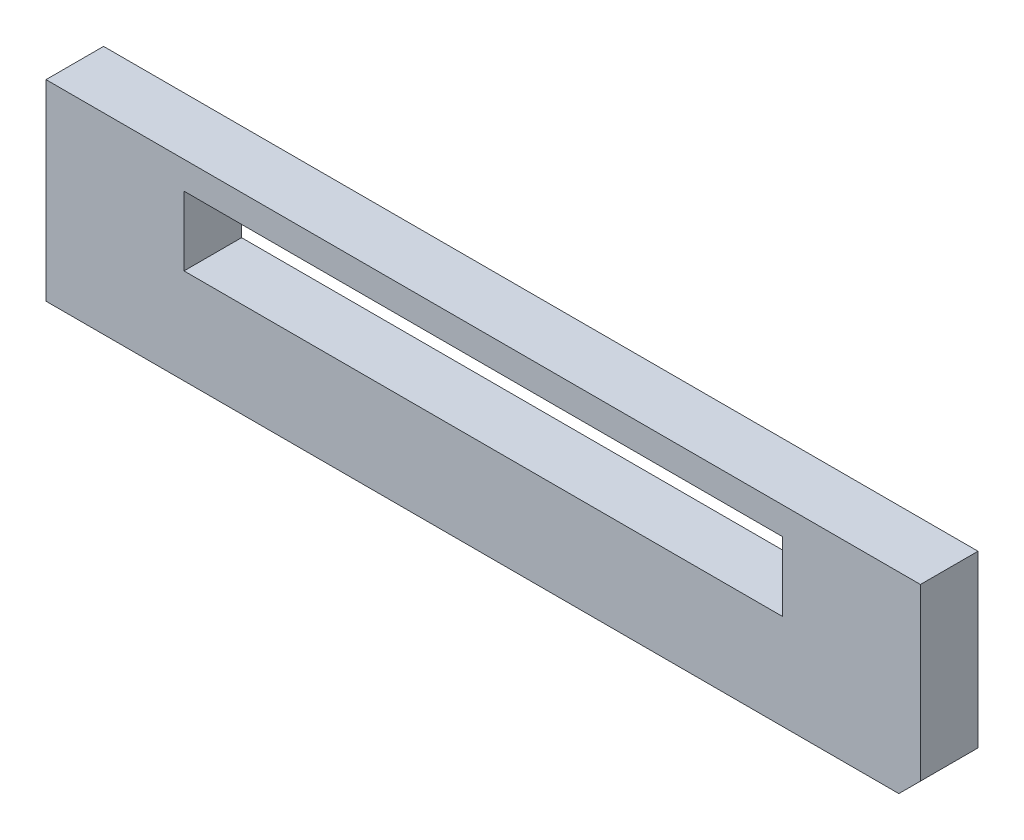
ISO-10303-21;
HEADER;
FILE_DESCRIPTION(('STEP AP214'),'2;1');
FILE_NAME('part.step','',(''),(''),'','','');
FILE_SCHEMA(('AUTOMOTIVE_DESIGN { 1 0 10303 214 1 1 1 1 }'));
ENDSEC;
DATA;
#1=APPLICATION_CONTEXT('core data for automotive mechanical design processes');
#2=APPLICATION_PROTOCOL_DEFINITION('international standard','automotive_design',2000,#1);
#3=PRODUCT_CONTEXT('',#1,'mechanical');
#4=PRODUCT('Part','Part','',(#3));
#5=PRODUCT_RELATED_PRODUCT_CATEGORY('part','',(#4));
#6=PRODUCT_DEFINITION_FORMATION('','',#4);
#7=PRODUCT_DEFINITION_CONTEXT('part definition',#1,'design');
#8=PRODUCT_DEFINITION('design','',#6,#7);
#9=PRODUCT_DEFINITION_SHAPE('','',#8);
#10=(LENGTH_UNIT() NAMED_UNIT(*) SI_UNIT(.MILLI.,.METRE.));
#11=(NAMED_UNIT(*) PLANE_ANGLE_UNIT() SI_UNIT($,.RADIAN.));
#12=(NAMED_UNIT(*) SI_UNIT($,.STERADIAN.) SOLID_ANGLE_UNIT());
#13=UNCERTAINTY_MEASURE_WITH_UNIT(LENGTH_MEASURE(1.E-05),#10,'distance_accuracy_value','');
#14=(GEOMETRIC_REPRESENTATION_CONTEXT(3) GLOBAL_UNCERTAINTY_ASSIGNED_CONTEXT((#13)) GLOBAL_UNIT_ASSIGNED_CONTEXT((#10,
#11,#12)) REPRESENTATION_CONTEXT('',''));
#15=CARTESIAN_POINT('',(0.,0.,0.));
#16=DIRECTION('',(0.,0.,1.));
#17=DIRECTION('',(1.,0.,0.));
#18=AXIS2_PLACEMENT_3D('',#15,#16,#17);
#19=CARTESIAN_POINT('',(0.,0.,5.34));
#20=DIRECTION('',(1.,0.,0.));
#21=DIRECTION('',(0.,0.,-1.));
#22=AXIS2_PLACEMENT_3D('',#19,#20,#21);
#23=PLANE('',#22);
#24=DIRECTION('',(0.,-1.,0.));
#25=VECTOR('',#24,1.);
#26=CARTESIAN_POINT('',(0.,0.,0.));
#27=LINE('',#26,#25);
#28=CARTESIAN_POINT('',(0.,17.8,0.));
#29=VERTEX_POINT('',#28);
#30=CARTESIAN_POINT('',(0.,0.,0.));
#31=VERTEX_POINT('',#30);
#32=EDGE_CURVE('E142',#29,#31,#27,.T.);
#33=ORIENTED_EDGE('',*,*,#32,.T.);
#34=DIRECTION('',(0.,0.,-1.));
#35=VECTOR('',#34,1.);
#36=CARTESIAN_POINT('',(0.,0.,5.34));
#37=LINE('',#36,#35);
#38=CARTESIAN_POINT('',(0.,0.,5.34));
#39=VERTEX_POINT('',#38);
#40=EDGE_CURVE('E171',#39,#31,#37,.T.);
#41=ORIENTED_EDGE('',*,*,#40,.F.);
#42=DIRECTION('',(0.,-1.,0.));
#43=VECTOR('',#42,1.);
#44=CARTESIAN_POINT('',(0.,0.,5.34));
#45=LINE('',#44,#43);
#46=CARTESIAN_POINT('',(0.,17.8,5.34));
#47=VERTEX_POINT('',#46);
#48=EDGE_CURVE('E146',#47,#39,#45,.T.);
#49=ORIENTED_EDGE('',*,*,#48,.F.);
#50=DIRECTION('',(0.,0.,-1.));
#51=VECTOR('',#50,1.);
#52=CARTESIAN_POINT('',(0.,17.8,5.34));
#53=LINE('',#52,#51);
#54=EDGE_CURVE('E157',#47,#29,#53,.T.);
#55=ORIENTED_EDGE('',*,*,#54,.T.);
#56=EDGE_LOOP('',(#33,#41,#49,#55));
#57=FACE_BOUND('',#56,.T.);
#58=ADVANCED_FACE('F38',(#57),#23,.F.);
#59=CARTESIAN_POINT('',(0.,0.,5.34));
#60=DIRECTION('',(0.,1.,0.));
#61=DIRECTION('',(0.,0.,1.));
#62=AXIS2_PLACEMENT_3D('',#59,#60,#61);
#63=PLANE('',#62);
#64=DIRECTION('',(1.,0.,0.));
#65=VECTOR('',#64,1.);
#66=CARTESIAN_POINT('',(0.,0.,0.));
#67=LINE('',#66,#65);
#68=CARTESIAN_POINT('',(79.1,0.,0.));
#69=VERTEX_POINT('',#68);
#70=EDGE_CURVE('E160',#31,#69,#67,.T.);
#71=ORIENTED_EDGE('',*,*,#70,.T.);
#72=DIRECTION('',(0.,0.,1.));
#73=VECTOR('',#72,1.);
#74=CARTESIAN_POINT('',(79.1,0.,5.34));
#75=LINE('',#74,#73);
#76=CARTESIAN_POINT('',(79.1,0.,5.34));
#77=VERTEX_POINT('',#76);
#78=EDGE_CURVE('E47',#69,#77,#75,.T.);
#79=ORIENTED_EDGE('',*,*,#78,.T.);
#80=DIRECTION('',(1.,0.,0.));
#81=VECTOR('',#80,1.);
#82=CARTESIAN_POINT('',(0.,0.,5.34));
#83=LINE('',#82,#81);
#84=EDGE_CURVE('E149',#39,#77,#83,.T.);
#85=ORIENTED_EDGE('',*,*,#84,.F.);
#86=ORIENTED_EDGE('',*,*,#40,.T.);
#87=EDGE_LOOP('',(#71,#79,#85,#86));
#88=FACE_BOUND('',#87,.T.);
#89=ADVANCED_FACE('F180',(#88),#63,.F.);
#90=CARTESIAN_POINT('',(81.1,0.,5.34));
#91=DIRECTION('',(-1.,0.,0.));
#92=DIRECTION('',(0.,0.,1.));
#93=AXIS2_PLACEMENT_3D('',#90,#91,#92);
#94=PLANE('',#93);
#95=DIRECTION('',(0.,1.,0.));
#96=VECTOR('',#95,1.);
#97=CARTESIAN_POINT('',(81.1,0.,5.34));
#98=LINE('',#97,#96);
#99=CARTESIAN_POINT('',(81.1,2.,5.34));
#100=VERTEX_POINT('',#99);
#101=CARTESIAN_POINT('',(81.1,17.8,5.34));
#102=VERTEX_POINT('',#101);
#103=EDGE_CURVE('E153',#100,#102,#98,.T.);
#104=ORIENTED_EDGE('',*,*,#103,.F.);
#105=DIRECTION('',(0.,0.,-1.));
#106=VECTOR('',#105,1.);
#107=CARTESIAN_POINT('',(81.1,2.,5.34));
#108=LINE('',#107,#106);
#109=CARTESIAN_POINT('',(81.1,2.,0.));
#110=VERTEX_POINT('',#109);
#111=EDGE_CURVE('E174',#100,#110,#108,.T.);
#112=ORIENTED_EDGE('',*,*,#111,.T.);
#113=DIRECTION('',(0.,1.,0.));
#114=VECTOR('',#113,1.);
#115=CARTESIAN_POINT('',(81.1,0.,0.));
#116=LINE('',#115,#114);
#117=CARTESIAN_POINT('',(81.1,17.8,0.));
#118=VERTEX_POINT('',#117);
#119=EDGE_CURVE('E163',#110,#118,#116,.T.);
#120=ORIENTED_EDGE('',*,*,#119,.T.);
#121=DIRECTION('',(0.,0.,-1.));
#122=VECTOR('',#121,1.);
#123=CARTESIAN_POINT('',(81.1,17.8,5.34));
#124=LINE('',#123,#122);
#125=EDGE_CURVE('E168',#102,#118,#124,.T.);
#126=ORIENTED_EDGE('',*,*,#125,.F.);
#127=EDGE_LOOP('',(#104,#112,#120,#126));
#128=FACE_BOUND('',#127,.T.);
#129=ADVANCED_FACE('F191',(#128),#94,.F.);
#130=CARTESIAN_POINT('',(0.,17.8,5.34));
#131=DIRECTION('',(0.,-1.,0.));
#132=DIRECTION('',(0.,0.,-1.));
#133=AXIS2_PLACEMENT_3D('',#130,#131,#132);
#134=PLANE('',#133);
#135=DIRECTION('',(-1.,0.,0.));
#136=VECTOR('',#135,1.);
#137=CARTESIAN_POINT('',(0.,17.8,0.));
#138=LINE('',#137,#136);
#139=EDGE_CURVE('E150',#118,#29,#138,.T.);
#140=ORIENTED_EDGE('',*,*,#139,.T.);
#141=ORIENTED_EDGE('',*,*,#54,.F.);
#142=DIRECTION('',(-1.,0.,0.));
#143=VECTOR('',#142,1.);
#144=CARTESIAN_POINT('',(0.,17.8,5.34));
#145=LINE('',#144,#143);
#146=EDGE_CURVE('E155',#102,#47,#145,.T.);
#147=ORIENTED_EDGE('',*,*,#146,.F.);
#148=ORIENTED_EDGE('',*,*,#125,.T.);
#149=EDGE_LOOP('',(#140,#141,#147,#148));
#150=FACE_BOUND('',#149,.T.);
#151=ADVANCED_FACE('F197',(#150),#134,.F.);
#152=CARTESIAN_POINT('',(0.,0.,5.34));
#153=DIRECTION('',(0.,0.,-1.));
#154=DIRECTION('',(-1.,0.,0.));
#155=AXIS2_PLACEMENT_3D('',#152,#153,#154);
#156=PLANE('',#155);
#157=DIRECTION('',(1.,0.,0.));
#158=VECTOR('',#157,1.);
#159=CARTESIAN_POINT('',(12.8,8.83392320543626,5.34));
#160=LINE('',#159,#158);
#161=CARTESIAN_POINT('',(12.8,8.83392320543626,5.34));
#162=VERTEX_POINT('',#161);
#163=CARTESIAN_POINT('',(68.3,8.83392320543626,5.34));
#164=VERTEX_POINT('',#163);
#165=EDGE_CURVE('E136',#162,#164,#160,.T.);
#166=ORIENTED_EDGE('',*,*,#165,.F.);
#167=DIRECTION('',(0.,-1.,0.));
#168=VECTOR('',#167,1.);
#169=CARTESIAN_POINT('',(12.8,8.83392320543626,5.34));
#170=LINE('',#169,#168);
#171=CARTESIAN_POINT('',(12.8,15.24337227812,5.34));
#172=VERTEX_POINT('',#171);
#173=EDGE_CURVE('E54',#172,#162,#170,.T.);
#174=ORIENTED_EDGE('',*,*,#173,.F.);
#175=DIRECTION('',(-1.,0.,0.));
#176=VECTOR('',#175,1.);
#177=CARTESIAN_POINT('',(12.8,15.24337227812,5.34));
#178=LINE('',#177,#176);
#179=CARTESIAN_POINT('',(68.3,15.24337227812,5.34));
#180=VERTEX_POINT('',#179);
#181=EDGE_CURVE('E127',#180,#172,#178,.T.);
#182=ORIENTED_EDGE('',*,*,#181,.F.);
#183=DIRECTION('',(0.,1.,0.));
#184=VECTOR('',#183,1.);
#185=CARTESIAN_POINT('',(68.3,8.83392320543626,5.34));
#186=LINE('',#185,#184);
#187=EDGE_CURVE('E130',#164,#180,#186,.T.);
#188=ORIENTED_EDGE('',*,*,#187,.F.);
#189=EDGE_LOOP('',(#166,#174,#182,#188));
#190=FACE_BOUND('',#189,.T.);
#191=ORIENTED_EDGE('',*,*,#84,.T.);
#192=DIRECTION('',(-0.707106781186553,-0.707106781186542,0.));
#193=VECTOR('',#192,1.);
#194=CARTESIAN_POINT('',(81.1,2.,5.34));
#195=LINE('',#194,#193);
#196=EDGE_CURVE('E11',#77,#100,#195,.F.);
#197=ORIENTED_EDGE('',*,*,#196,.T.);
#198=ORIENTED_EDGE('',*,*,#103,.T.);
#199=ORIENTED_EDGE('',*,*,#146,.T.);
#200=ORIENTED_EDGE('',*,*,#48,.T.);
#201=EDGE_LOOP('',(#191,#197,#198,#199,#200));
#202=FACE_BOUND('',#201,.T.);
#203=ADVANCED_FACE('F184',(#190,#202),#156,.F.);
#204=CARTESIAN_POINT('',(0.,0.,0.));
#205=DIRECTION('',(0.,0.,-1.));
#206=DIRECTION('',(-1.,0.,0.));
#207=AXIS2_PLACEMENT_3D('',#204,#205,#206);
#208=PLANE('',#207);
#209=DIRECTION('',(0.,-1.,0.));
#210=VECTOR('',#209,1.);
#211=CARTESIAN_POINT('',(12.8,8.83392320543626,0.));
#212=LINE('',#211,#210);
#213=CARTESIAN_POINT('',(12.8,15.24337227812,0.));
#214=VERTEX_POINT('',#213);
#215=CARTESIAN_POINT('',(12.8,8.83392320543626,0.));
#216=VERTEX_POINT('',#215);
#217=EDGE_CURVE('E111',#214,#216,#212,.T.);
#218=ORIENTED_EDGE('',*,*,#217,.T.);
#219=DIRECTION('',(1.,0.,0.));
#220=VECTOR('',#219,1.);
#221=CARTESIAN_POINT('',(12.8,8.83392320543626,0.));
#222=LINE('',#221,#220);
#223=CARTESIAN_POINT('',(68.3,8.83392320543626,0.));
#224=VERTEX_POINT('',#223);
#225=EDGE_CURVE('E120',#216,#224,#222,.T.);
#226=ORIENTED_EDGE('',*,*,#225,.T.);
#227=DIRECTION('',(0.,1.,0.));
#228=VECTOR('',#227,1.);
#229=CARTESIAN_POINT('',(68.3,8.83392320543626,0.));
#230=LINE('',#229,#228);
#231=CARTESIAN_POINT('',(68.3,15.24337227812,0.));
#232=VERTEX_POINT('',#231);
#233=EDGE_CURVE('E62',#224,#232,#230,.T.);
#234=ORIENTED_EDGE('',*,*,#233,.T.);
#235=DIRECTION('',(-1.,0.,0.));
#236=VECTOR('',#235,1.);
#237=CARTESIAN_POINT('',(12.8,15.24337227812,0.));
#238=LINE('',#237,#236);
#239=EDGE_CURVE('E117',#232,#214,#238,.T.);
#240=ORIENTED_EDGE('',*,*,#239,.T.);
#241=EDGE_LOOP('',(#218,#226,#234,#240));
#242=FACE_BOUND('',#241,.T.);
#243=ORIENTED_EDGE('',*,*,#119,.F.);
#244=DIRECTION('',(0.707106781186553,0.707106781186542,0.));
#245=VECTOR('',#244,1.);
#246=CARTESIAN_POINT('',(39.5499999999994,-39.55,0.));
#247=LINE('',#246,#245);
#248=EDGE_CURVE('E177',#110,#69,#247,.F.);
#249=ORIENTED_EDGE('',*,*,#248,.T.);
#250=ORIENTED_EDGE('',*,*,#70,.F.);
#251=ORIENTED_EDGE('',*,*,#32,.F.);
#252=ORIENTED_EDGE('',*,*,#139,.F.);
#253=EDGE_LOOP('',(#243,#249,#250,#251,#252));
#254=FACE_BOUND('',#253,.T.);
#255=ADVANCED_FACE('F124',(#242,#254),#208,.T.);
#256=CARTESIAN_POINT('',(81.1,2.,5.34));
#257=DIRECTION('',(-0.707106781186542,0.707106781186553,0.));
#258=DIRECTION('',(0.,0.,-1.));
#259=AXIS2_PLACEMENT_3D('',#256,#257,#258);
#260=PLANE('',#259);
#261=ORIENTED_EDGE('',*,*,#196,.F.);
#262=ORIENTED_EDGE('',*,*,#78,.F.);
#263=ORIENTED_EDGE('',*,*,#248,.F.);
#264=ORIENTED_EDGE('',*,*,#111,.F.);
#265=EDGE_LOOP('',(#261,#262,#263,#264));
#266=FACE_BOUND('',#265,.T.);
#267=ADVANCED_FACE('F41',(#266),#260,.F.);
#268=CARTESIAN_POINT('',(12.8,8.83392320543626,0.));
#269=DIRECTION('',(-1.,0.,0.));
#270=DIRECTION('',(0.,0.,1.));
#271=AXIS2_PLACEMENT_3D('',#268,#269,#270);
#272=PLANE('',#271);
#273=ORIENTED_EDGE('',*,*,#173,.T.);
#274=DIRECTION('',(0.,0.,1.));
#275=VECTOR('',#274,1.);
#276=CARTESIAN_POINT('',(12.8,8.83392320543626,0.));
#277=LINE('',#276,#275);
#278=EDGE_CURVE('E107',#216,#162,#277,.T.);
#279=ORIENTED_EDGE('',*,*,#278,.F.);
#280=ORIENTED_EDGE('',*,*,#217,.F.);
#281=DIRECTION('',(0.,0.,1.));
#282=VECTOR('',#281,1.);
#283=CARTESIAN_POINT('',(12.8,15.24337227812,0.));
#284=LINE('',#283,#282);
#285=EDGE_CURVE('E140',#214,#172,#284,.T.);
#286=ORIENTED_EDGE('',*,*,#285,.T.);
#287=EDGE_LOOP('',(#273,#279,#280,#286));
#288=FACE_BOUND('',#287,.T.);
#289=ADVANCED_FACE('F109',(#288),#272,.F.);
#290=CARTESIAN_POINT('',(12.8,15.24337227812,0.));
#291=DIRECTION('',(0.,1.,0.));
#292=DIRECTION('',(0.,0.,1.));
#293=AXIS2_PLACEMENT_3D('',#290,#291,#292);
#294=PLANE('',#293);
#295=ORIENTED_EDGE('',*,*,#181,.T.);
#296=ORIENTED_EDGE('',*,*,#285,.F.);
#297=ORIENTED_EDGE('',*,*,#239,.F.);
#298=DIRECTION('',(0.,0.,1.));
#299=VECTOR('',#298,1.);
#300=CARTESIAN_POINT('',(68.3,15.24337227812,0.));
#301=LINE('',#300,#299);
#302=EDGE_CURVE('E143',#232,#180,#301,.T.);
#303=ORIENTED_EDGE('',*,*,#302,.T.);
#304=EDGE_LOOP('',(#295,#296,#297,#303));
#305=FACE_BOUND('',#304,.T.);
#306=ADVANCED_FACE('F217',(#305),#294,.F.);
#307=CARTESIAN_POINT('',(68.3,8.83392320543626,0.));
#308=DIRECTION('',(1.,0.,0.));
#309=DIRECTION('',(0.,0.,-1.));
#310=AXIS2_PLACEMENT_3D('',#307,#308,#309);
#311=PLANE('',#310);
#312=ORIENTED_EDGE('',*,*,#187,.T.);
#313=ORIENTED_EDGE('',*,*,#302,.F.);
#314=ORIENTED_EDGE('',*,*,#233,.F.);
#315=DIRECTION('',(0.,0.,1.));
#316=VECTOR('',#315,1.);
#317=CARTESIAN_POINT('',(68.3,8.83392320543626,0.));
#318=LINE('',#317,#316);
#319=EDGE_CURVE('E116',#224,#164,#318,.T.);
#320=ORIENTED_EDGE('',*,*,#319,.T.);
#321=EDGE_LOOP('',(#312,#313,#314,#320));
#322=FACE_BOUND('',#321,.T.);
#323=ADVANCED_FACE('F220',(#322),#311,.F.);
#324=CARTESIAN_POINT('',(12.8,8.83392320543626,0.));
#325=DIRECTION('',(0.,-1.,0.));
#326=DIRECTION('',(0.,0.,-1.));
#327=AXIS2_PLACEMENT_3D('',#324,#325,#326);
#328=PLANE('',#327);
#329=ORIENTED_EDGE('',*,*,#165,.T.);
#330=ORIENTED_EDGE('',*,*,#319,.F.);
#331=ORIENTED_EDGE('',*,*,#225,.F.);
#332=ORIENTED_EDGE('',*,*,#278,.T.);
#333=EDGE_LOOP('',(#329,#330,#331,#332));
#334=FACE_BOUND('',#333,.T.);
#335=ADVANCED_FACE('F121',(#334),#328,.F.);
#336=CLOSED_SHELL('',(#58,#89,#129,#151,#203,#255,#267,#289,#306,#323,#335));
#337=MANIFOLD_SOLID_BREP('B2',#336);
#338=ADVANCED_BREP_SHAPE_REPRESENTATION('',(#18,#337),#14);
#339=SHAPE_DEFINITION_REPRESENTATION(#9,#338);
ENDSEC;
END-ISO-10303-21;
